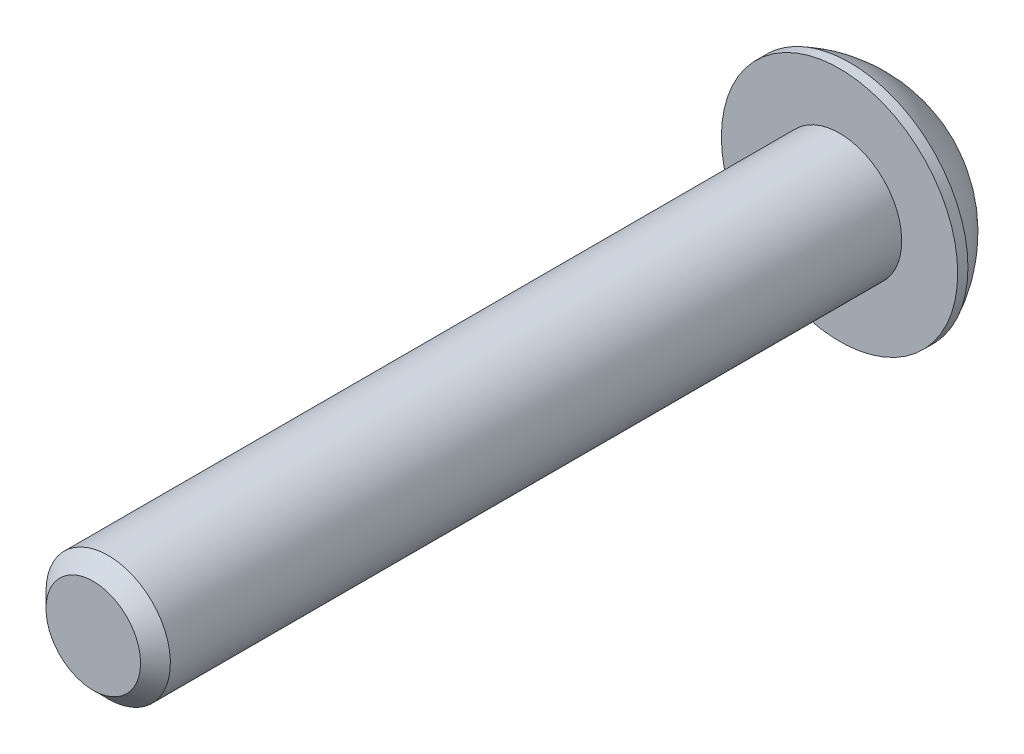
ISO-10303-21;
HEADER;
FILE_DESCRIPTION(('STEP AP214'),'2;1');
FILE_NAME('part.step','',(''),(''),'','','');
FILE_SCHEMA(('AUTOMOTIVE_DESIGN { 1 0 10303 214 1 1 1 1 }'));
ENDSEC;
DATA;
#1=APPLICATION_CONTEXT('core data for automotive mechanical design processes');
#2=APPLICATION_PROTOCOL_DEFINITION('international standard','automotive_design',2000,#1);
#3=PRODUCT_CONTEXT('',#1,'mechanical');
#4=PRODUCT('Part','Part','',(#3));
#5=PRODUCT_RELATED_PRODUCT_CATEGORY('part','',(#4));
#6=PRODUCT_DEFINITION_FORMATION('','',#4);
#7=PRODUCT_DEFINITION_CONTEXT('part definition',#1,'design');
#8=PRODUCT_DEFINITION('design','',#6,#7);
#9=PRODUCT_DEFINITION_SHAPE('','',#8);
#10=(LENGTH_UNIT() NAMED_UNIT(*) SI_UNIT(.MILLI.,.METRE.));
#11=(NAMED_UNIT(*) PLANE_ANGLE_UNIT() SI_UNIT($,.RADIAN.));
#12=(NAMED_UNIT(*) SI_UNIT($,.STERADIAN.) SOLID_ANGLE_UNIT());
#13=UNCERTAINTY_MEASURE_WITH_UNIT(LENGTH_MEASURE(1.E-05),#10,'distance_accuracy_value','');
#14=(GEOMETRIC_REPRESENTATION_CONTEXT(3) GLOBAL_UNCERTAINTY_ASSIGNED_CONTEXT((#13)) GLOBAL_UNIT_ASSIGNED_CONTEXT((#10,
#11,#12)) REPRESENTATION_CONTEXT('',''));
#15=CARTESIAN_POINT('',(0.,0.,0.));
#16=DIRECTION('',(0.,0.,1.));
#17=DIRECTION('',(1.,0.,0.));
#18=AXIS2_PLACEMENT_3D('',#15,#16,#17);
#19=CARTESIAN_POINT('',(1.5,-0.866025403784438,1.925));
#20=DIRECTION('',(0.,0.,1.));
#21=DIRECTION('',(1.,0.,0.));
#22=AXIS2_PLACEMENT_3D('',#19,#20,#21);
#23=PLANE('',#22);
#24=DIRECTION('',(-0.866025403784439,0.5,0.));
#25=VECTOR('',#24,1.);
#26=CARTESIAN_POINT('',(-1.5,-0.866025403784439,1.925));
#27=LINE('',#26,#25);
#28=CARTESIAN_POINT('',(-1.5,-0.866025403784439,1.925));
#29=VERTEX_POINT('',#28);
#30=CARTESIAN_POINT('',(0.,-1.73205080756888,1.925));
#31=VERTEX_POINT('',#30);
#32=EDGE_CURVE('E89',#29,#31,#27,.F.);
#33=ORIENTED_EDGE('',*,*,#32,.F.);
#34=DIRECTION('',(0.,1.,0.));
#35=VECTOR('',#34,1.);
#36=CARTESIAN_POINT('',(-1.5,0.866025403784438,1.925));
#37=LINE('',#36,#35);
#38=CARTESIAN_POINT('',(-1.5,0.86602540378444,1.925));
#39=VERTEX_POINT('',#38);
#40=EDGE_CURVE('E69',#39,#29,#37,.F.);
#41=ORIENTED_EDGE('',*,*,#40,.F.);
#42=DIRECTION('',(0.866025403784438,0.5,0.));
#43=VECTOR('',#42,1.);
#44=CARTESIAN_POINT('',(0.,1.73205080756888,1.925));
#45=LINE('',#44,#43);
#46=CARTESIAN_POINT('',(0.,1.73205080756888,1.925));
#47=VERTEX_POINT('',#46);
#48=EDGE_CURVE('E108',#47,#39,#45,.F.);
#49=ORIENTED_EDGE('',*,*,#48,.F.);
#50=DIRECTION('',(0.866025403784439,-0.5,0.));
#51=VECTOR('',#50,1.);
#52=CARTESIAN_POINT('',(1.5,0.866025403784439,1.925));
#53=LINE('',#52,#51);
#54=CARTESIAN_POINT('',(1.5,0.866025403784439,1.925));
#55=VERTEX_POINT('',#54);
#56=EDGE_CURVE('E74',#55,#47,#53,.F.);
#57=ORIENTED_EDGE('',*,*,#56,.F.);
#58=DIRECTION('',(0.,1.,0.));
#59=VECTOR('',#58,1.);
#60=CARTESIAN_POINT('',(1.5,-0.866025403784438,1.925));
#61=LINE('',#60,#59);
#62=CARTESIAN_POINT('',(1.5,-0.866025403784439,1.925));
#63=VERTEX_POINT('',#62);
#64=EDGE_CURVE('E116',#63,#55,#61,.T.);
#65=ORIENTED_EDGE('',*,*,#64,.F.);
#66=DIRECTION('',(-0.866025403784438,-0.5,0.));
#67=VECTOR('',#66,1.);
#68=CARTESIAN_POINT('',(0.,-1.73205080756888,1.925));
#69=LINE('',#68,#67);
#70=EDGE_CURVE('E91',#31,#63,#69,.F.);
#71=ORIENTED_EDGE('',*,*,#70,.F.);
#72=EDGE_LOOP('',(#33,#41,#49,#57,#65,#71));
#73=FACE_BOUND('',#72,.T.);
#74=ADVANCED_FACE('F17',(#73),#23,.F.);
#75=CARTESIAN_POINT('',(-1.5,0.866025403784438,1.925));
#76=DIRECTION('',(1.,0.,0.));
#77=DIRECTION('',(0.,1.,0.));
#78=AXIS2_PLACEMENT_3D('',#75,#76,#77);
#79=PLANE('',#78);
#80=DIRECTION('',(0.,0.,1.));
#81=VECTOR('',#80,1.);
#82=CARTESIAN_POINT('',(-1.5,-0.866025403784439,1.925));
#83=LINE('',#82,#81);
#84=CARTESIAN_POINT('',(-1.50000000002135,-0.866025403796766,2.46510916132268E-11));
#85=VERTEX_POINT('',#84);
#86=EDGE_CURVE('E59',#85,#29,#83,.T.);
#87=ORIENTED_EDGE('',*,*,#86,.F.);
#88=CARTESIAN_POINT('',(-1.4999999999998,-0.866025403812883,3.497257389451E-11));
#89=CARTESIAN_POINT('',(-1.49999999999993,-0.806493971458483,0.0297371504859719));
#90=CARTESIAN_POINT('',(-1.49999999999998,-0.745967172639482,0.0577274997356712));
#91=CARTESIAN_POINT('',(-1.50000000000002,-0.622546818448653,0.108976634302055));
#92=CARTESIAN_POINT('',(-1.50000000000001,-0.559641532208188,0.132206913934862));
#93=CARTESIAN_POINT('',(-1.5,-0.432796107455125,0.172000539080811));
#94=CARTESIAN_POINT('',(-1.5,-0.368888255245699,0.188663877377684));
#95=CARTESIAN_POINT('',(-1.5,-0.239666012718551,0.214336924424236));
#96=CARTESIAN_POINT('',(-1.5,-0.174355567110582,0.223365789946761));
#97=CARTESIAN_POINT('',(-1.5,-0.0617869553803678,0.231512589389946));
#98=CARTESIAN_POINT('',(-1.5,-0.0146740941290627,0.232718117598397));
#99=CARTESIAN_POINT('',(-1.5,0.0794684067864031,0.230683861885897));
#100=CARTESIAN_POINT('',(-1.5,0.126498025769629,0.227443096008092));
#101=CARTESIAN_POINT('',(-1.5,0.22010432228685,0.21670269479537));
#102=CARTESIAN_POINT('',(-1.5,0.266680537614034,0.209199099190673));
#103=CARTESIAN_POINT('',(-1.5,0.359051186180354,0.190340526502742));
#104=CARTESIAN_POINT('',(-1.5,0.404845275088566,0.178983896805698));
#105=CARTESIAN_POINT('',(-1.5,0.522097698449399,0.145281418704612));
#106=CARTESIAN_POINT('',(-1.5,0.592830045625335,0.120399016572433));
#107=CARTESIAN_POINT('',(-1.5,0.696834190269759,0.0783962698582894));
#108=CARTESIAN_POINT('',(-1.5,0.731106784740956,0.0636393457765503));
#109=CARTESIAN_POINT('',(-1.5,0.799022021654026,0.0327784721118597));
#110=CARTESIAN_POINT('',(-1.5,0.832664954619754,0.0166751634844623));
#111=CARTESIAN_POINT('',(-1.5,0.866025403812908,3.50675416900233E-11));
#112=B_SPLINE_CURVE_WITH_KNOTS('',3,(#88,#89,#90,#91,#92,#93,#94,#95,#96,#97,#98,#99,#100,#101,
#102,#103,#104,#105,#106,#107,#108,#109,#110,#111),.UNSPECIFIED.,.F.,.F.,(4,2,2,2,2,2,2,2,2,2,2,
4),(0.,0.199774419877747,0.400712312213008,0.598459990242252,0.795709985580835,
0.936894690699466,1.07811058125136,1.21945787975417,1.36086588065946,1.58533909974464,
1.69726364726936,1.80913521246463),.UNSPECIFIED.);
#113=CARTESIAN_POINT('',(-1.5000000000427,0.866025403774032,1.75297927214847E-11));
#114=VERTEX_POINT('',#113);
#115=EDGE_CURVE('E20',#85,#114,#112,.T.);
#116=ORIENTED_EDGE('',*,*,#115,.T.);
#117=DIRECTION('',(0.,0.,1.));
#118=VECTOR('',#117,1.);
#119=CARTESIAN_POINT('',(-1.5,0.86602540378444,1.925));
#120=LINE('',#119,#118);
#121=EDGE_CURVE('E85',#39,#114,#120,.F.);
#122=ORIENTED_EDGE('',*,*,#121,.F.);
#123=ORIENTED_EDGE('',*,*,#40,.T.);
#124=EDGE_LOOP('',(#87,#116,#122,#123));
#125=FACE_BOUND('',#124,.T.);
#126=ADVANCED_FACE('F84',(#125),#79,.T.);
#127=CARTESIAN_POINT('',(-1.5,-0.866025403784439,1.925));
#128=DIRECTION('',(0.5,0.866025403784439,0.));
#129=DIRECTION('',(-0.866025403784439,0.5,0.));
#130=AXIS2_PLACEMENT_3D('',#127,#128,#129);
#131=PLANE('',#130);
#132=DIRECTION('',(0.,0.,1.));
#133=VECTOR('',#132,1.);
#134=CARTESIAN_POINT('',(0.,-1.73205080756888,1.925));
#135=LINE('',#134,#133);
#136=CARTESIAN_POINT('',(0.,-1.73205080759353,2.46497940526791E-11));
#137=VERTEX_POINT('',#136);
#138=EDGE_CURVE('E94',#137,#31,#135,.T.);
#139=ORIENTED_EDGE('',*,*,#138,.F.);
#140=CARTESIAN_POINT('',(2.47314203792776E-11,-1.73205080758293,3.49731040819305E-11));
#141=CARTESIAN_POINT('',(-0.0515557327287603,-1.70228509139958,0.029737150484999));
#142=CARTESIAN_POINT('',(-0.103973478126701,-1.67202169198382,0.0577274997332092));
#143=CARTESIAN_POINT('',(-0.210858640221861,-1.61031151487585,0.108976634295228));
#144=CARTESIAN_POINT('',(-0.265336216149327,-1.57885887174931,0.132206913925155));
#145=CARTESIAN_POINT('',(-0.375187576360522,-1.51543615936052,0.172000539063643));
#146=CARTESIAN_POINT('',(-0.430533399885507,-1.48348223324985,0.188663877355986));
#147=CARTESIAN_POINT('',(-0.542443144668121,-1.41887111197467,0.214336924391903));
#148=CARTESIAN_POINT('',(-0.599003649706895,-1.38621588916503,0.223365789908325));
#149=CARTESIAN_POINT('',(-0.696490927156704,-1.32993158328682,0.231512589340654));
#150=CARTESIAN_POINT('',(-0.737291861858444,-1.30637515265358,0.232718117543908));
#151=CARTESIAN_POINT('',(-0.818821659252819,-1.25930390218097,0.230683861819339));
#152=CARTESIAN_POINT('',(-0.859550504035242,-1.23578909268205,0.22744309593466));
#153=CARTESIAN_POINT('',(-0.940615934798046,-1.18898594440917,0.216702694706976));
#154=CARTESIAN_POINT('',(-0.980952120495589,-1.16569783673861,0.20919909909419));
#155=CARTESIAN_POINT('',(-1.06094744874167,-1.11951251244183,0.19034052638936));
#156=CARTESIAN_POINT('',(-1.10060629309087,-1.09661546798107,0.178983896683506));
#157=CARTESIAN_POINT('',(-1.20214987033849,-1.03798925632268,0.145281418581615));
#158=CARTESIAN_POINT('',(-1.26340587981439,-1.00262308276228,0.120399016466317));
#159=CARTESIAN_POINT('',(-1.35347611110698,-0.950621010479538,0.0783962697862537));
#160=CARTESIAN_POINT('',(-1.38315704855032,-0.93348471325682,0.0636393457173699));
#161=CARTESIAN_POINT('',(-1.44197336897757,-0.899527094825408,0.0327784720806831));
#162=CARTESIAN_POINT('',(-1.4711090035625,-0.882705628354788,0.0166751634684291));
#163=CARTESIAN_POINT('',(-1.50000000002465,-0.866025403770205,3.50675335169267E-11));
#164=B_SPLINE_CURVE_WITH_KNOTS('',3,(#140,#141,#142,#143,#144,#145,#146,#147,#148,#149,#150,
#151,#152,#153,#154,#155,#156,#157,#158,#159,#160,#161,#162,#163),.UNSPECIFIED.,.F.,.F.,(4,2,2,
2,2,2,2,2,2,2,2,4),(0.,0.199774419910088,0.4007123122777,0.598459990337995,0.795709985707603,
0.936894690871224,1.07811058146816,1.21945788001607,1.36086588096647,1.58533909988034,
1.69726364731887,1.80913521242832),.UNSPECIFIED.);
#165=EDGE_CURVE('E98',#137,#85,#164,.T.);
#166=ORIENTED_EDGE('',*,*,#165,.T.);
#167=ORIENTED_EDGE('',*,*,#86,.T.);
#168=ORIENTED_EDGE('',*,*,#32,.T.);
#169=EDGE_LOOP('',(#139,#166,#167,#168));
#170=FACE_BOUND('',#169,.T.);
#171=ADVANCED_FACE('F96',(#170),#131,.T.);
#172=CARTESIAN_POINT('',(0.,-1.73205080756888,1.925));
#173=DIRECTION('',(-0.5,0.866025403784438,0.));
#174=DIRECTION('',(-0.866025403784438,-0.5,0.));
#175=AXIS2_PLACEMENT_3D('',#172,#173,#174);
#176=PLANE('',#175);
#177=DIRECTION('',(0.,0.,1.));
#178=VECTOR('',#177,1.);
#179=CARTESIAN_POINT('',(1.5,-0.866025403784439,1.925));
#180=LINE('',#179,#178);
#181=CARTESIAN_POINT('',(1.50000000002135,-0.866025403796764,2.46510166454315E-11));
#182=VERTEX_POINT('',#181);
#183=EDGE_CURVE('E118',#182,#63,#180,.T.);
#184=ORIENTED_EDGE('',*,*,#183,.F.);
#185=CARTESIAN_POINT('',(1.50000000002453,-0.86602540377005,3.49716705376729E-11));
#186=CARTESIAN_POINT('',(1.44844426727117,-0.895791119953619,0.0297371504849977));
#187=CARTESIAN_POINT('',(1.39602652187328,-0.926054519369463,0.0577274997332081));
#188=CARTESIAN_POINT('',(1.28914135977816,-0.987764696477502,0.108976634295226));
#189=CARTESIAN_POINT('',(1.23466378385068,-1.01921733960401,0.132206913925153));
#190=CARTESIAN_POINT('',(1.12481242363947,-1.08264005199279,0.172000539063641));
#191=CARTESIAN_POINT('',(1.06946660011449,-1.11459397810346,0.188663877355984));
#192=CARTESIAN_POINT('',(0.957556855331882,-1.17920509937865,0.214336924391901));
#193=CARTESIAN_POINT('',(0.900996350293107,-1.21186032218829,0.223365789908323));
#194=CARTESIAN_POINT('',(0.803509072843297,-1.2681446280665,0.231512589340651));
#195=CARTESIAN_POINT('',(0.762708138141558,-1.29170105869973,0.232718117543906));
#196=CARTESIAN_POINT('',(0.681178340747183,-1.33877230917235,0.230683861819337));
#197=CARTESIAN_POINT('',(0.64044949596476,-1.36228711867127,0.227443095934657));
#198=CARTESIAN_POINT('',(0.559384065201955,-1.40909026694414,0.216702694706973));
#199=CARTESIAN_POINT('',(0.519047879504413,-1.4323783746147,0.209199099094188));
#200=CARTESIAN_POINT('',(0.439052551258335,-1.47856369891149,0.190340526389358));
#201=CARTESIAN_POINT('',(0.399393706909129,-1.50146074337225,0.178983896683504));
#202=CARTESIAN_POINT('',(0.29785012966151,-1.56008695503064,0.145281418581613));
#203=CARTESIAN_POINT('',(0.236594120185611,-1.59545312859104,0.120399016466315));
#204=CARTESIAN_POINT('',(0.146523888893026,-1.64745520087378,0.0783962697862515));
#205=CARTESIAN_POINT('',(0.116842951449678,-1.6645914980965,0.0636393457173677));
#206=CARTESIAN_POINT('',(0.0580266310224356,-1.69854911652791,0.0327784720806809));
#207=CARTESIAN_POINT('',(0.0288909964375044,-1.71537058299853,0.0166751634684269));
#208=CARTESIAN_POINT('',(-2.46528885257916E-11,-1.73205080758311,3.50654309737692E-11));
#209=B_SPLINE_CURVE_WITH_KNOTS('',3,(#185,#186,#187,#188,#189,#190,#191,#192,#193,#194,#195,
#196,#197,#198,#199,#200,#201,#202,#203,#204,#205,#206,#207,#208),.UNSPECIFIED.,.F.,.F.,(4,2,2,
2,2,2,2,2,2,2,2,4),(0.,0.199774419910088,0.400712312277698,0.598459990337992,0.795709985707599,
0.93689469087122,1.07811058146816,1.21945788001607,1.36086588096647,1.58533909988034,
1.69726364731887,1.80913521242832),.UNSPECIFIED.);
#210=EDGE_CURVE('E176',#182,#137,#209,.T.);
#211=ORIENTED_EDGE('',*,*,#210,.T.);
#212=ORIENTED_EDGE('',*,*,#138,.T.);
#213=ORIENTED_EDGE('',*,*,#70,.T.);
#214=EDGE_LOOP('',(#184,#211,#212,#213));
#215=FACE_BOUND('',#214,.T.);
#216=ADVANCED_FACE('F174',(#215),#176,.T.);
#217=CARTESIAN_POINT('',(1.5,-0.866025403784438,1.925));
#218=DIRECTION('',(-1.,0.,0.));
#219=DIRECTION('',(0.,0.,1.));
#220=AXIS2_PLACEMENT_3D('',#217,#218,#219);
#221=PLANE('',#220);
#222=DIRECTION('',(0.,0.,1.));
#223=VECTOR('',#222,1.);
#224=CARTESIAN_POINT('',(1.5,0.866025403784439,1.925));
#225=LINE('',#224,#223);
#226=CARTESIAN_POINT('',(1.50000000002135,0.866025403796765,2.46510166454315E-11));
#227=VERTEX_POINT('',#226);
#228=EDGE_CURVE('E113',#227,#55,#225,.T.);
#229=ORIENTED_EDGE('',*,*,#228,.F.);
#230=CARTESIAN_POINT('',(1.4999999999998,0.866025403812882,3.49731264126921E-11));
#231=CARTESIAN_POINT('',(1.49999999999993,0.806493971458483,0.0297371504859723));
#232=CARTESIAN_POINT('',(1.49999999999998,0.745967172639481,0.0577274997356716));
#233=CARTESIAN_POINT('',(1.50000000000002,0.622546818448653,0.108976634302055));
#234=CARTESIAN_POINT('',(1.50000000000001,0.559641532208188,0.132206913934863));
#235=CARTESIAN_POINT('',(1.5,0.432796107455125,0.172000539080811));
#236=CARTESIAN_POINT('',(1.5,0.368888255245699,0.188663877377684));
#237=CARTESIAN_POINT('',(1.5,0.239666012718551,0.214336924424236));
#238=CARTESIAN_POINT('',(1.5,0.174355567110582,0.223365789946761));
#239=CARTESIAN_POINT('',(1.5,0.0617869553803679,0.231512589389946));
#240=CARTESIAN_POINT('',(1.5,0.0146740941290628,0.232718117598397));
#241=CARTESIAN_POINT('',(1.5,-0.0794684067864029,0.230683861885897));
#242=CARTESIAN_POINT('',(1.5,-0.126498025769629,0.227443096008093));
#243=CARTESIAN_POINT('',(1.5,-0.220104322286849,0.21670269479537));
#244=CARTESIAN_POINT('',(1.5,-0.266680537614034,0.209199099190673));
#245=CARTESIAN_POINT('',(1.5,-0.359051186180354,0.190340526502742));
#246=CARTESIAN_POINT('',(1.5,-0.404845275088565,0.178983896805698));
#247=CARTESIAN_POINT('',(1.5,-0.522097698449399,0.145281418704612));
#248=CARTESIAN_POINT('',(1.5,-0.592830045625335,0.120399016572433));
#249=CARTESIAN_POINT('',(1.5,-0.69683419026976,0.0783962698582893));
#250=CARTESIAN_POINT('',(1.5,-0.731106784740956,0.0636393457765502));
#251=CARTESIAN_POINT('',(1.5,-0.799022021654026,0.0327784721118594));
#252=CARTESIAN_POINT('',(1.5,-0.832664954619755,0.0166751634844619));
#253=CARTESIAN_POINT('',(1.5,-0.866025403812909,3.5067108651531E-11));
#254=B_SPLINE_CURVE_WITH_KNOTS('',3,(#230,#231,#232,#233,#234,#235,#236,#237,#238,#239,#240,
#241,#242,#243,#244,#245,#246,#247,#248,#249,#250,#251,#252,#253),.UNSPECIFIED.,.F.,.F.,(4,2,2,
2,2,2,2,2,2,2,2,4),(0.,0.199774419877746,0.400712312213007,0.598459990242251,0.795709985580833,
0.936894690699465,1.07811058125136,1.21945787975417,1.36086588065946,1.58533909974464,
1.69726364726936,1.80913521246463),.UNSPECIFIED.);
#255=EDGE_CURVE('E181',#227,#182,#254,.T.);
#256=ORIENTED_EDGE('',*,*,#255,.T.);
#257=ORIENTED_EDGE('',*,*,#183,.T.);
#258=ORIENTED_EDGE('',*,*,#64,.T.);
#259=EDGE_LOOP('',(#229,#256,#257,#258));
#260=FACE_BOUND('',#259,.T.);
#261=ADVANCED_FACE('F233',(#260),#221,.T.);
#262=CARTESIAN_POINT('',(1.5,0.866025403784439,1.925));
#263=DIRECTION('',(-0.5,-0.866025403784439,0.));
#264=DIRECTION('',(0.866025403784439,-0.5,0.));
#265=AXIS2_PLACEMENT_3D('',#262,#263,#264);
#266=PLANE('',#265);
#267=DIRECTION('',(0.,0.,1.));
#268=VECTOR('',#267,1.);
#269=CARTESIAN_POINT('',(0.,1.73205080756888,1.925));
#270=LINE('',#269,#268);
#271=CARTESIAN_POINT('',(0.,1.73205080759353,2.46496717940041E-11));
#272=VERTEX_POINT('',#271);
#273=EDGE_CURVE('E40',#272,#47,#270,.T.);
#274=ORIENTED_EDGE('',*,*,#273,.F.);
#275=CARTESIAN_POINT('',(-2.47305004476744E-11,1.73205080758293,3.49737059739202E-11));
#276=CARTESIAN_POINT('',(0.051555732728761,1.70228509139958,0.0297371504849995));
#277=CARTESIAN_POINT('',(0.103973478126702,1.67202169198382,0.0577274997332096));
#278=CARTESIAN_POINT('',(0.210858640221861,1.61031151487585,0.108976634295228));
#279=CARTESIAN_POINT('',(0.265336216149327,1.57885887174931,0.132206913925155));
#280=CARTESIAN_POINT('',(0.375187576360522,1.51543615936052,0.172000539063643));
#281=CARTESIAN_POINT('',(0.430533399885507,1.48348223324985,0.188663877355987));
#282=CARTESIAN_POINT('',(0.542443144668121,1.41887111197467,0.214336924391904));
#283=CARTESIAN_POINT('',(0.599003649706895,1.38621588916503,0.223365789908325));
#284=CARTESIAN_POINT('',(0.696490927156705,1.32993158328682,0.231512589340654));
#285=CARTESIAN_POINT('',(0.737291861858444,1.30637515265358,0.232718117543908));
#286=CARTESIAN_POINT('',(0.81882165925282,1.25930390218097,0.230683861819339));
#287=CARTESIAN_POINT('',(0.859550504035242,1.23578909268205,0.22744309593466));
#288=CARTESIAN_POINT('',(0.940615934798047,1.18898594440917,0.216702694706976));
#289=CARTESIAN_POINT('',(0.980952120495589,1.16569783673861,0.20919909909419));
#290=CARTESIAN_POINT('',(1.06094744874167,1.11951251244183,0.19034052638936));
#291=CARTESIAN_POINT('',(1.10060629309087,1.09661546798107,0.178983896683506));
#292=CARTESIAN_POINT('',(1.20214987033849,1.03798925632268,0.145281418581615));
#293=CARTESIAN_POINT('',(1.26340587981439,1.00262308276228,0.120399016466317));
#294=CARTESIAN_POINT('',(1.35347611110698,0.950621010479537,0.0783962697862536));
#295=CARTESIAN_POINT('',(1.38315704855032,0.93348471325682,0.0636393457173698));
#296=CARTESIAN_POINT('',(1.44197336897757,0.899527094825408,0.0327784720806828));
#297=CARTESIAN_POINT('',(1.4711090035625,0.882705628354787,0.0166751634684288));
#298=CARTESIAN_POINT('',(1.50000000002466,0.866025403770204,3.50673327179663E-11));
#299=B_SPLINE_CURVE_WITH_KNOTS('',3,(#275,#276,#277,#278,#279,#280,#281,#282,#283,#284,#285,
#286,#287,#288,#289,#290,#291,#292,#293,#294,#295,#296,#297,#298),.UNSPECIFIED.,.F.,.F.,(4,2,2,
2,2,2,2,2,2,2,2,4),(0.,0.199774419910088,0.4007123122777,0.598459990337994,0.795709985707602,
0.936894690871223,1.07811058146816,1.21945788001607,1.36086588096647,1.58533909988034,
1.69726364731887,1.80913521242832),.UNSPECIFIED.);
#300=EDGE_CURVE('E212',#272,#227,#299,.T.);
#301=ORIENTED_EDGE('',*,*,#300,.T.);
#302=ORIENTED_EDGE('',*,*,#228,.T.);
#303=ORIENTED_EDGE('',*,*,#56,.T.);
#304=EDGE_LOOP('',(#274,#301,#302,#303));
#305=FACE_BOUND('',#304,.T.);
#306=ADVANCED_FACE('F226',(#305),#266,.T.);
#307=CARTESIAN_POINT('',(0.,1.73205080756888,1.925));
#308=DIRECTION('',(0.5,-0.866025403784438,0.));
#309=DIRECTION('',(0.866025403784438,0.5,0.));
#310=AXIS2_PLACEMENT_3D('',#307,#308,#309);
#311=PLANE('',#310);
#312=ORIENTED_EDGE('',*,*,#121,.T.);
#313=CARTESIAN_POINT('',(-1.50000000002453,0.866025403770049,3.49715716480713E-11));
#314=CARTESIAN_POINT('',(-1.44844426727117,0.895791119953618,0.0297371504849977));
#315=CARTESIAN_POINT('',(-1.39602652187328,0.926054519369463,0.0577274997332081));
#316=CARTESIAN_POINT('',(-1.28914135977816,0.987764696477502,0.108976634295226));
#317=CARTESIAN_POINT('',(-1.23466378385068,1.01921733960401,0.132206913925154));
#318=CARTESIAN_POINT('',(-1.12481242363947,1.08264005199279,0.172000539063642));
#319=CARTESIAN_POINT('',(-1.06946660011449,1.11459397810346,0.188663877355985));
#320=CARTESIAN_POINT('',(-0.957556855331882,1.17920509937865,0.214336924391901));
#321=CARTESIAN_POINT('',(-0.900996350293106,1.21186032218828,0.223365789908323));
#322=CARTESIAN_POINT('',(-0.803509072843297,1.2681446280665,0.231512589340651));
#323=CARTESIAN_POINT('',(-0.762708138141558,1.29170105869973,0.232718117543906));
#324=CARTESIAN_POINT('',(-0.681178340747182,1.33877230917235,0.230683861819337));
#325=CARTESIAN_POINT('',(-0.64044949596476,1.36228711867127,0.227443095934658));
#326=CARTESIAN_POINT('',(-0.559384065201955,1.40909026694414,0.216702694706974));
#327=CARTESIAN_POINT('',(-0.519047879504412,1.4323783746147,0.209199099094188));
#328=CARTESIAN_POINT('',(-0.439052551258335,1.47856369891149,0.190340526389358));
#329=CARTESIAN_POINT('',(-0.399393706909128,1.50146074337225,0.178983896683504));
#330=CARTESIAN_POINT('',(-0.297850129661509,1.56008695503064,0.145281418581613));
#331=CARTESIAN_POINT('',(-0.23659412018561,1.59545312859104,0.120399016466315));
#332=CARTESIAN_POINT('',(-0.146523888893025,1.64745520087378,0.0783962697862515));
#333=CARTESIAN_POINT('',(-0.116842951449677,1.6645914980965,0.0636393457173676));
#334=CARTESIAN_POINT('',(-0.0580266310224344,1.69854911652791,0.0327784720806807));
#335=CARTESIAN_POINT('',(-0.0288909964375033,1.71537058299853,0.0166751634684267));
#336=CARTESIAN_POINT('',(2.46540148375053E-11,1.73205080758311,3.50653193413085E-11));
#337=B_SPLINE_CURVE_WITH_KNOTS('',3,(#313,#314,#315,#316,#317,#318,#319,#320,#321,#322,#323,
#324,#325,#326,#327,#328,#329,#330,#331,#332,#333,#334,#335,#336),.UNSPECIFIED.,.F.,.F.,(4,2,2,
2,2,2,2,2,2,2,2,4),(0.,0.199774419910088,0.400712312277699,0.598459990337993,0.795709985707601,
0.936894690871222,1.07811058146816,1.21945788001607,1.36086588096647,1.58533909988034,
1.69726364731887,1.80913521242832),.UNSPECIFIED.);
#338=EDGE_CURVE('E202',#114,#272,#337,.T.);
#339=ORIENTED_EDGE('',*,*,#338,.T.);
#340=ORIENTED_EDGE('',*,*,#273,.T.);
#341=ORIENTED_EDGE('',*,*,#48,.T.);
#342=EDGE_LOOP('',(#312,#339,#340,#341));
#343=FACE_BOUND('',#342,.T.);
#344=ADVANCED_FACE('F222',(#343),#311,.T.);
#345=CARTESIAN_POINT('',(0.,0.,0.));
#346=DIRECTION('',(0.,0.,-1.));
#347=DIRECTION('',(-1.,0.,0.));
#348=AXIS2_PLACEMENT_3D('',#345,#346,#347);
#349=CONICAL_SURFACE('',#348,1.73205080761818,0.785398163397448);
#350=ORIENTED_EDGE('',*,*,#115,.F.);
#351=CARTESIAN_POINT('',(0.,0.,0.));
#352=DIRECTION('',(0.,0.,-1.));
#353=DIRECTION('',(-1.,0.,0.));
#354=AXIS2_PLACEMENT_3D('',#351,#352,#353);
#355=CIRCLE('',#354,1.73205080761818);
#356=EDGE_CURVE('E200',#114,#85,#355,.F.);
#357=ORIENTED_EDGE('',*,*,#356,.F.);
#358=EDGE_LOOP('',(#350,#357));
#359=FACE_BOUND('',#358,.T.);
#360=ADVANCED_FACE('F225',(#359),#349,.F.);
#361=CARTESIAN_POINT('',(0.,0.,0.));
#362=DIRECTION('',(0.,0.,-1.));
#363=DIRECTION('',(-1.,0.,0.));
#364=AXIS2_PLACEMENT_3D('',#361,#362,#363);
#365=CONICAL_SURFACE('',#364,1.73205080761818,0.785398163519197);
#366=ORIENTED_EDGE('',*,*,#165,.F.);
#367=CARTESIAN_POINT('',(0.,0.,0.));
#368=DIRECTION('',(0.,0.,-1.));
#369=DIRECTION('',(-1.,0.,0.));
#370=AXIS2_PLACEMENT_3D('',#367,#368,#369);
#371=CIRCLE('',#370,1.73205080761818);
#372=EDGE_CURVE('E187',#85,#137,#371,.F.);
#373=ORIENTED_EDGE('',*,*,#372,.F.);
#374=EDGE_LOOP('',(#366,#373));
#375=FACE_BOUND('',#374,.T.);
#376=ADVANCED_FACE('F185',(#375),#365,.F.);
#377=CARTESIAN_POINT('',(0.,0.,0.));
#378=DIRECTION('',(0.,0.,-1.));
#379=DIRECTION('',(-1.,0.,0.));
#380=AXIS2_PLACEMENT_3D('',#377,#378,#379);
#381=CONICAL_SURFACE('',#380,1.73205080761818,0.785398163519197);
#382=ORIENTED_EDGE('',*,*,#210,.F.);
#383=CARTESIAN_POINT('',(0.,0.,0.));
#384=DIRECTION('',(0.,0.,-1.));
#385=DIRECTION('',(-1.,0.,0.));
#386=AXIS2_PLACEMENT_3D('',#383,#384,#385);
#387=CIRCLE('',#386,1.73205080761818);
#388=EDGE_CURVE('E190',#137,#182,#387,.F.);
#389=ORIENTED_EDGE('',*,*,#388,.F.);
#390=EDGE_LOOP('',(#382,#389));
#391=FACE_BOUND('',#390,.T.);
#392=ADVANCED_FACE('F191',(#391),#381,.F.);
#393=CARTESIAN_POINT('',(0.,0.,0.));
#394=DIRECTION('',(0.,0.,-1.));
#395=DIRECTION('',(-1.,0.,0.));
#396=AXIS2_PLACEMENT_3D('',#393,#394,#395);
#397=CONICAL_SURFACE('',#396,1.73205080761818,0.785398163397448);
#398=CARTESIAN_POINT('',(0.,0.,0.));
#399=DIRECTION('',(0.,0.,-1.));
#400=DIRECTION('',(-1.,0.,0.));
#401=AXIS2_PLACEMENT_3D('',#398,#399,#400);
#402=CIRCLE('',#401,1.73205080761818);
#403=EDGE_CURVE('E194',#182,#227,#402,.F.);
#404=ORIENTED_EDGE('',*,*,#403,.F.);
#405=ORIENTED_EDGE('',*,*,#255,.F.);
#406=EDGE_LOOP('',(#404,#405));
#407=FACE_BOUND('',#406,.T.);
#408=ADVANCED_FACE('F250',(#407),#397,.F.);
#409=CARTESIAN_POINT('',(0.,0.,0.));
#410=DIRECTION('',(0.,0.,-1.));
#411=DIRECTION('',(-1.,0.,0.));
#412=AXIS2_PLACEMENT_3D('',#409,#410,#411);
#413=CONICAL_SURFACE('',#412,1.73205080761818,0.785398163519197);
#414=ORIENTED_EDGE('',*,*,#300,.F.);
#415=CARTESIAN_POINT('',(0.,0.,0.));
#416=DIRECTION('',(0.,0.,-1.));
#417=DIRECTION('',(-1.,0.,0.));
#418=AXIS2_PLACEMENT_3D('',#415,#416,#417);
#419=CIRCLE('',#418,1.73205080761818);
#420=EDGE_CURVE('E435',#227,#272,#419,.F.);
#421=ORIENTED_EDGE('',*,*,#420,.F.);
#422=EDGE_LOOP('',(#414,#421));
#423=FACE_BOUND('',#422,.T.);
#424=ADVANCED_FACE('F253',(#423),#413,.F.);
#425=CARTESIAN_POINT('',(0.,0.,0.));
#426=DIRECTION('',(0.,0.,-1.));
#427=DIRECTION('',(-1.,0.,0.));
#428=AXIS2_PLACEMENT_3D('',#425,#426,#427);
#429=CONICAL_SURFACE('',#428,1.73205080761818,0.785398163519197);
#430=ORIENTED_EDGE('',*,*,#338,.F.);
#431=CARTESIAN_POINT('',(0.,0.,0.));
#432=DIRECTION('',(0.,0.,-1.));
#433=DIRECTION('',(-1.,0.,0.));
#434=AXIS2_PLACEMENT_3D('',#431,#432,#433);
#435=CIRCLE('',#434,1.73205080761818);
#436=EDGE_CURVE('E145',#272,#114,#435,.F.);
#437=ORIENTED_EDGE('',*,*,#436,.F.);
#438=EDGE_LOOP('',(#430,#437));
#439=FACE_BOUND('',#438,.T.);
#440=ADVANCED_FACE('F220',(#439),#429,.F.);
#441=CARTESIAN_POINT('',(0.,-2.5,0.));
#442=DIRECTION('',(0.,0.,-1.));
#443=DIRECTION('',(-1.,0.,0.));
#444=AXIS2_PLACEMENT_3D('',#441,#442,#443);
#445=PLANE('',#444);
#446=ORIENTED_EDGE('',*,*,#420,.T.);
#447=ORIENTED_EDGE('',*,*,#436,.T.);
#448=ORIENTED_EDGE('',*,*,#356,.T.);
#449=ORIENTED_EDGE('',*,*,#372,.T.);
#450=ORIENTED_EDGE('',*,*,#388,.T.);
#451=ORIENTED_EDGE('',*,*,#403,.T.);
#452=EDGE_LOOP('',(#446,#447,#448,#449,#450,#451));
#453=FACE_BOUND('',#452,.T.);
#454=CARTESIAN_POINT('',(0.,2.50000000000001,0.));
#455=CARTESIAN_POINT('',(0.14042610491613,2.49999377288615,-1.32593105193051E-13));
#456=CARTESIAN_POINT('',(0.280954031991922,2.48812860484107,-6.31471711953224E-13));
#457=CARTESIAN_POINT('',(0.558139658492342,2.4409607490297,6.32232181879444E-13));
#458=CARTESIAN_POINT('',(0.694792493265104,2.40562985309162,2.39753884257632E-12));
#459=CARTESIAN_POINT('',(0.960172122561409,2.31253633023375,2.40243984571378E-12));
#460=CARTESIAN_POINT('',(1.08890266852492,2.25478441650811,6.4371637005254E-13));
#461=CARTESIAN_POINT('',(1.33480476215491,2.11850293856877,-6.43556416365108E-13));
#462=CARTESIAN_POINT('',(1.4519791741075,2.03997854084978,-1.72659782751567E-13));
#463=CARTESIAN_POINT('',(1.67149637287933,1.86436525899235,1.7224414644879E-13));
#464=CARTESIAN_POINT('',(1.77383760642253,1.76727443311116,0.));
#465=CARTESIAN_POINT('',(1.9607710897206,1.55728537034384,0.));
#466=CARTESIAN_POINT('',(2.04536264247662,1.44438651299416,0.));
#467=CARTESIAN_POINT('',(2.19438926048051,1.20599153577208,0.));
#468=CARTESIAN_POINT('',(2.25882470109938,1.08049565055396,0.));
#469=CARTESIAN_POINT('',(2.36571190425966,0.82046757520668,0.));
#470=CARTESIAN_POINT('',(2.40816371100575,0.685935403248304,0.));
#471=CARTESIAN_POINT('',(2.46987884513361,0.411653235766121,0.));
#472=CARTESIAN_POINT('',(2.48914212830969,0.271903230295767,0.));
#473=CARTESIAN_POINT('',(2.50393321907299,-0.00884700938581499,0.));
#474=CARTESIAN_POINT('',(2.49946106942909,-0.149847241343802,0.));
#475=CARTESIAN_POINT('',(2.46690834048229,-0.42909566110566,0.));
#476=CARTESIAN_POINT('',(2.43882775236998,-0.567343847882595,0.));
#477=CARTESIAN_POINT('',(2.35985521676829,-0.83716381023195,0.));
#478=CARTESIAN_POINT('',(2.30896324519904,-0.968735578756534,0.));
#479=CARTESIAN_POINT('',(2.18581263152622,-1.22146756661806,0.));
#480=CARTESIAN_POINT('',(2.11355399637581,-1.34262778934312,0.));
#481=CARTESIAN_POINT('',(1.9497212937071,-1.571097303558,0.));
#482=CARTESIAN_POINT('',(1.85814723400703,-1.67840660065418,0.));
#483=CARTESIAN_POINT('',(1.65828316813499,-1.87612814061525,0.));
#484=CARTESIAN_POINT('',(1.54999315967222,-1.96654038116453,0.));
#485=CARTESIAN_POINT('',(1.31977122488191,-2.12790126296043,0.));
#486=CARTESIAN_POINT('',(1.1978392967716,-2.19884990166348,0.));
#487=CARTESIAN_POINT('',(0.943794829063103,-2.31926953799947,0.));
#488=CARTESIAN_POINT('',(0.811682289900807,-2.368740536552,0.));
#489=CARTESIAN_POINT('',(0.54102688833757,-2.44480055905627,0.));
#490=CARTESIAN_POINT('',(0.40248402622632,-2.47138958403887,1.86091487096489E-13));
#491=CARTESIAN_POINT('',(0.122900797575768,-2.50093087897621,-1.8559004359156E-13));
#492=CARTESIAN_POINT('',(-0.0181395689635298,-2.50388314893098,-6.93687455967223E-13));
#493=CARTESIAN_POINT('',(-0.298714091660284,-2.48606712714886,6.93687487218265E-13));
#494=CARTESIAN_POINT('',(-0.438248247749883,-2.46529883434335,2.5891599510617E-12));
#495=CARTESIAN_POINT('',(-0.711849384339752,-2.40063123468838,2.27462519808315E-12));
#496=CARTESIAN_POINT('',(-0.845916364605931,-2.35673192684851,0.));
#497=CARTESIAN_POINT('',(-1.10477735834652,-2.24704847617181,0.));
#498=CARTESIAN_POINT('',(-1.22957137303274,-2.18126433619496,2.01615343233563E-12));
#499=CARTESIAN_POINT('',(-1.46634390401783,-2.02967864834025,2.36532436318756E-12));
#500=CARTESIAN_POINT('',(-1.57832242207293,-1.94387710320558,6.33724587120533E-13));
#501=CARTESIAN_POINT('',(-1.78628528220637,-1.75469221428793,-6.33724843631077E-13));
#502=CARTESIAN_POINT('',(-1.88226961781078,-1.65130886338843,-1.69573609549075E-13));
#503=CARTESIAN_POINT('',(-2.05551937194207,-1.42989510132752,1.69790505201427E-13));
#504=CARTESIAN_POINT('',(-2.13278478437745,-1.31186468539968,0.));
#505=CARTESIAN_POINT('',(-2.26640324060879,-1.06450749101078,0.));
#506=CARTESIAN_POINT('',(-2.32275630647993,-0.935180724474396,0.));
#507=CARTESIAN_POINT('',(-2.41295047224871,-0.668901974735267,0.));
#508=CARTESIAN_POINT('',(-2.4467915805466,-0.531949994377864,0.));
#509=CARTESIAN_POINT('',(-2.49100125494042,-0.254308178115924,0.));
#510=CARTESIAN_POINT('',(-2.501369778741,-0.11361833547658,0.));
#511=CARTESIAN_POINT('',(-2.49833983643023,0.167504919749186,0.));
#512=CARTESIAN_POINT('',(-2.48494141562714,0.307938332823943,0.));
#513=CARTESIAN_POINT('',(-2.43475793877015,0.584562794538336,0.));
#514=CARTESIAN_POINT('',(-2.39797283569017,0.720753834646809,0.));
#515=CARTESIAN_POINT('',(-2.30205936796065,0.985029646530014,0.));
#516=CARTESIAN_POINT('',(-2.24293058718864,1.11311426728117,0.));
#517=CARTESIAN_POINT('',(-2.10401075902969,1.35753360981387,0.));
#518=CARTESIAN_POINT('',(-2.02422052292128,1.47386879269151,0.));
#519=CARTESIAN_POINT('',(-1.84625229096998,1.69148114008355,0.));
#520=CARTESIAN_POINT('',(-1.74807621990904,1.7927598788425,0.));
#521=CARTESIAN_POINT('',(-1.53608575842467,1.9774231538066,0.));
#522=CARTESIAN_POINT('',(-1.42226748721672,2.06080323621401,0.));
#523=CARTESIAN_POINT('',(-1.18220372565674,2.2073028677133,0.));
#524=CARTESIAN_POINT('',(-1.05595232774909,2.27041272419883,0.));
#525=CARTESIAN_POINT('',(-0.794745243184798,2.37446817640475,0.));
#526=CARTESIAN_POINT('',(-0.659800208998127,2.4154403407284,0.));
#527=CARTESIAN_POINT('',(-0.436662637239037,2.46313736176947,0.));
#528=CARTESIAN_POINT('',(-0.34991999775826,2.47694359911887,0.));
#529=CARTESIAN_POINT('',(-0.175464826042746,2.49537686389633,0.));
#530=CARTESIAN_POINT('',(-0.0877522938080067,2.50000389132438,0.));
#531=CARTESIAN_POINT('',(0.,2.50000000000001,0.));
#532=B_SPLINE_CURVE_WITH_KNOTS('',3,(#454,#455,#456,#457,#458,#459,#460,#461,#462,#463,#464,
#465,#466,#467,#468,#469,#470,#471,#472,#473,#474,#475,#476,#477,#478,#479,#480,#481,#482,#483,
#484,#485,#486,#487,#488,#489,#490,#491,#492,#493,#494,#495,#496,#497,#498,#499,#500,#501,#502,
#503,#504,#505,#506,#507,#508,#509,#510,#511,#512,#513,#514,#515,#516,#517,#518,#519,#520,#521,
#522,#523,#524,#525,#526,#527,#528,#529,#530,#531),.UNSPECIFIED.,.T.,.F.,(4,2,2,2,2,2,2,2,2,2,2,
2,2,2,2,2,2,2,2,2,2,2,2,2,2,2,2,2,2,2,2,2,2,2,2,2,2,2,4),(0.,0.420958019059747,
0.842422990224611,1.26368682467408,1.68484598149402,2.10604920874208,2.52726897280856,
2.94848089195443,3.36969196412426,3.7909038392729,4.21211495543996,4.63332622878055,
5.05453794675567,5.47574952765962,5.89696093807137,6.31817240620663,6.73938392938708,
7.16059543453285,7.58180692070278,8.00301840687236,8.42422991201778,8.84544143519829,
9.26665290333357,9.68786431374594,10.1090758946506,10.5302876126258,10.9514988859663,
11.3727100021334,11.793921877282,12.2151329494518,12.6363448685977,13.0575646326643,
13.4787678599123,13.8999270167319,14.3211908511815,14.742655822347,15.1636138414069,
15.4266705700074,15.689727298608),.UNSPECIFIED.);
#533=CARTESIAN_POINT('',(0.,2.50000000000001,0.));
#534=VERTEX_POINT('',#533);
#535=EDGE_CURVE('E137',#534,#534,#532,.F.);
#536=ORIENTED_EDGE('',*,*,#535,.F.);
#537=EDGE_LOOP('',(#536));
#538=FACE_BOUND('',#537,.T.);
#539=ADVANCED_FACE('F147',(#453,#538),#445,.T.);
#540=CARTESIAN_POINT('',(0.,0.,4.65805481283422));
#541=DIRECTION('',(0.,-1.,0.));
#542=DIRECTION('',(0.,0.,-1.));
#543=AXIS2_PLACEMENT_3D('',#540,#541,#542);
#544=SPHERICAL_SURFACE('',#543,5.28653711226622);
#545=ORIENTED_EDGE('',*,*,#535,.T.);
#546=EDGE_LOOP('',(#545));
#547=FACE_BOUND('',#546,.T.);
#548=CARTESIAN_POINT('',(0.,0.,2.3375));
#549=DIRECTION('',(0.,0.,1.));
#550=DIRECTION('',(1.,0.,0.));
#551=AXIS2_PLACEMENT_3D('',#548,#549,#550);
#552=CIRCLE('',#551,4.75);
#553=CARTESIAN_POINT('',(4.75,0.,2.3375));
#554=VERTEX_POINT('',#553);
#555=EDGE_CURVE('E134',#554,#554,#552,.T.);
#556=ORIENTED_EDGE('',*,*,#555,.F.);
#557=EDGE_LOOP('',(#556));
#558=FACE_BOUND('',#557,.T.);
#559=ADVANCED_FACE('F150',(#547,#558),#544,.T.);
#560=CARTESIAN_POINT('',(0.,0.,0.));
#561=DIRECTION('',(0.,0.,1.));
#562=DIRECTION('',(1.,0.,0.));
#563=AXIS2_PLACEMENT_3D('',#560,#561,#562);
#564=CYLINDRICAL_SURFACE('',#563,4.75);
#565=CARTESIAN_POINT('',(0.,0.,2.75));
#566=DIRECTION('',(0.,0.,1.));
#567=DIRECTION('',(1.,0.,0.));
#568=AXIS2_PLACEMENT_3D('',#565,#566,#567);
#569=CIRCLE('',#568,4.75);
#570=CARTESIAN_POINT('',(4.75,0.,2.75));
#571=VERTEX_POINT('',#570);
#572=EDGE_CURVE('E131',#571,#571,#569,.T.);
#573=ORIENTED_EDGE('',*,*,#572,.F.);
#574=EDGE_LOOP('',(#573));
#575=FACE_BOUND('',#574,.T.);
#576=ORIENTED_EDGE('',*,*,#555,.T.);
#577=EDGE_LOOP('',(#576));
#578=FACE_BOUND('',#577,.T.);
#579=ADVANCED_FACE('F155',(#575,#578),#564,.T.);
#580=CARTESIAN_POINT('',(0.,-2.5,32.75));
#581=DIRECTION('',(0.,0.,-1.));
#582=DIRECTION('',(0.,1.,0.));
#583=AXIS2_PLACEMENT_3D('',#580,#581,#582);
#584=PLANE('',#583);
#585=CARTESIAN_POINT('',(0.,0.,32.7499999999645));
#586=DIRECTION('',(0.,0.,-1.));
#587=DIRECTION('',(-1.,0.,0.));
#588=AXIS2_PLACEMENT_3D('',#585,#586,#587);
#589=CIRCLE('',#588,1.89999999997781);
#590=CARTESIAN_POINT('',(-1.89999999997781,0.,32.7499999999645));
#591=VERTEX_POINT('',#590);
#592=EDGE_CURVE('E128',#591,#591,#589,.T.);
#593=ORIENTED_EDGE('',*,*,#592,.F.);
#594=EDGE_LOOP('',(#593));
#595=FACE_BOUND('',#594,.T.);
#596=ADVANCED_FACE('F286',(#595),#584,.F.);
#597=CARTESIAN_POINT('',(0.,-4.75,2.75));
#598=DIRECTION('',(0.,0.,1.));
#599=DIRECTION('',(1.,0.,0.));
#600=AXIS2_PLACEMENT_3D('',#597,#598,#599);
#601=PLANE('',#600);
#602=CARTESIAN_POINT('',(0.,0.,2.75));
#603=DIRECTION('',(0.,0.,1.));
#604=DIRECTION('',(0.,-1.,0.));
#605=AXIS2_PLACEMENT_3D('',#602,#603,#604);
#606=CIRCLE('',#605,2.5);
#607=CARTESIAN_POINT('',(0.,-2.50000000000001,2.75));
#608=VERTEX_POINT('',#607);
#609=EDGE_CURVE('E31',#608,#608,#606,.T.);
#610=ORIENTED_EDGE('',*,*,#609,.F.);
#611=EDGE_LOOP('',(#610));
#612=FACE_BOUND('',#611,.T.);
#613=ORIENTED_EDGE('',*,*,#572,.T.);
#614=EDGE_LOOP('',(#613));
#615=FACE_BOUND('',#614,.T.);
#616=ADVANCED_FACE('F280',(#612,#615),#601,.T.);
#617=CARTESIAN_POINT('',(0.,0.,32.1500000000583));
#618=DIRECTION('',(0.,0.,-1.));
#619=DIRECTION('',(-1.,0.,0.));
#620=AXIS2_PLACEMENT_3D('',#617,#618,#619);
#621=CONICAL_SURFACE('',#620,2.4999999998272,0.785398163350079);
#622=ORIENTED_EDGE('',*,*,#592,.T.);
#623=EDGE_LOOP('',(#622));
#624=FACE_BOUND('',#623,.T.);
#625=CARTESIAN_POINT('',(0.,0.,32.15));
#626=DIRECTION('',(0.,0.,1.));
#627=DIRECTION('',(0.,-1.,0.));
#628=AXIS2_PLACEMENT_3D('',#625,#626,#627);
#629=CIRCLE('',#628,2.5);
#630=CARTESIAN_POINT('',(0.,-2.5,32.15));
#631=VERTEX_POINT('',#630);
#632=EDGE_CURVE('E11',#631,#631,#629,.F.);
#633=ORIENTED_EDGE('',*,*,#632,.F.);
#634=EDGE_LOOP('',(#633));
#635=FACE_BOUND('',#634,.T.);
#636=ADVANCED_FACE('F274',(#624,#635),#621,.T.);
#637=CARTESIAN_POINT('',(0.,0.,32.75));
#638=DIRECTION('',(0.,0.,1.));
#639=DIRECTION('',(0.,-1.,0.));
#640=AXIS2_PLACEMENT_3D('',#637,#638,#639);
#641=CYLINDRICAL_SURFACE('',#640,2.5);
#642=ORIENTED_EDGE('',*,*,#632,.T.);
#643=EDGE_LOOP('',(#642));
#644=FACE_BOUND('',#643,.T.);
#645=ORIENTED_EDGE('',*,*,#609,.T.);
#646=EDGE_LOOP('',(#645));
#647=FACE_BOUND('',#646,.T.);
#648=ADVANCED_FACE('F272',(#644,#647),#641,.T.);
#649=CLOSED_SHELL('',(#74,#126,#171,#216,#261,#306,#344,#360,#376,#392,#408,#424,#440,#539,#559,
#579,#596,#616,#636,#648));
#650=MANIFOLD_SOLID_BREP('B1',#649);
#651=ADVANCED_BREP_SHAPE_REPRESENTATION('',(#18,#650),#14);
#652=SHAPE_DEFINITION_REPRESENTATION(#9,#651);
ENDSEC;
END-ISO-10303-21;
